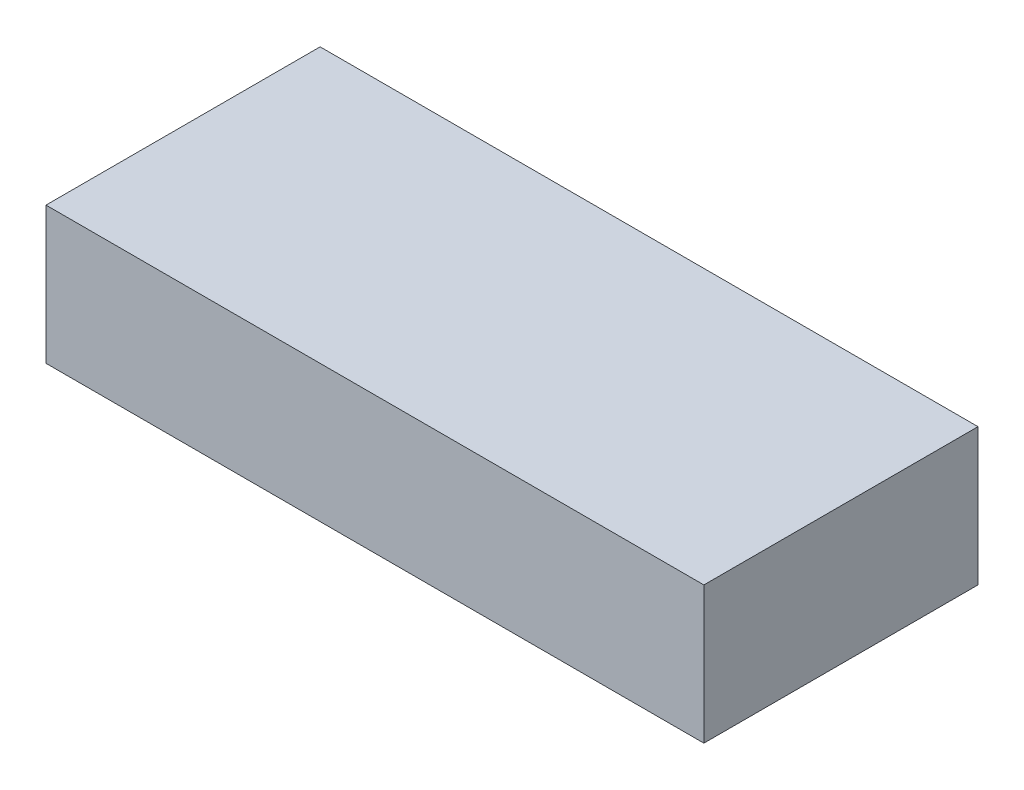
ISO-10303-21;
HEADER;
FILE_DESCRIPTION(('STEP AP214'),'2;1');
FILE_NAME('part.step','',(''),(''),'','','');
FILE_SCHEMA(('AUTOMOTIVE_DESIGN { 1 0 10303 214 1 1 1 1 }'));
ENDSEC;
DATA;
#1=APPLICATION_CONTEXT('core data for automotive mechanical design processes');
#2=APPLICATION_PROTOCOL_DEFINITION('international standard','automotive_design',2000,#1);
#3=PRODUCT_CONTEXT('',#1,'mechanical');
#4=PRODUCT('Part','Part','',(#3));
#5=PRODUCT_RELATED_PRODUCT_CATEGORY('part','',(#4));
#6=PRODUCT_DEFINITION_FORMATION('','',#4);
#7=PRODUCT_DEFINITION_CONTEXT('part definition',#1,'design');
#8=PRODUCT_DEFINITION('design','',#6,#7);
#9=PRODUCT_DEFINITION_SHAPE('','',#8);
#10=(LENGTH_UNIT() NAMED_UNIT(*) SI_UNIT(.MILLI.,.METRE.));
#11=(NAMED_UNIT(*) PLANE_ANGLE_UNIT() SI_UNIT($,.RADIAN.));
#12=(NAMED_UNIT(*) SI_UNIT($,.STERADIAN.) SOLID_ANGLE_UNIT());
#13=UNCERTAINTY_MEASURE_WITH_UNIT(LENGTH_MEASURE(1.E-05),#10,'distance_accuracy_value','');
#14=(GEOMETRIC_REPRESENTATION_CONTEXT(3) GLOBAL_UNCERTAINTY_ASSIGNED_CONTEXT((#13)) GLOBAL_UNIT_ASSIGNED_CONTEXT((#10,
#11,#12)) REPRESENTATION_CONTEXT('',''));
#15=CARTESIAN_POINT('',(0.,0.,0.));
#16=DIRECTION('',(0.,0.,1.));
#17=DIRECTION('',(1.,0.,0.));
#18=AXIS2_PLACEMENT_3D('',#15,#16,#17);
#19=CARTESIAN_POINT('',(0.0102075459339945,2.76860732929226,24.2545199157979));
#20=DIRECTION('',(0.,1.,0.));
#21=DIRECTION('',(1.,0.,0.));
#22=AXIS2_PLACEMENT_3D('',#19,#20,#21);
#23=PLANE('',#22);
#24=DIRECTION('',(1.,0.,0.));
#25=VECTOR('',#24,1.);
#26=CARTESIAN_POINT('',(-5.989792454066,2.76860732929226,21.7545199157979));
#27=LINE('',#26,#25);
#28=CARTESIAN_POINT('',(-5.989792454066,2.76860732929226,21.7545199157979));
#29=VERTEX_POINT('',#28);
#30=CARTESIAN_POINT('',(6.010207545934,2.76860732929226,21.7545199157979));
#31=VERTEX_POINT('',#30);
#32=EDGE_CURVE('E58',#29,#31,#27,.T.);
#33=ORIENTED_EDGE('',*,*,#32,.T.);
#34=DIRECTION('',(0.,0.,1.));
#35=VECTOR('',#34,1.);
#36=CARTESIAN_POINT('',(6.010207545934,2.76860732929226,21.7545199157979));
#37=LINE('',#36,#35);
#38=CARTESIAN_POINT('',(6.010207545934,2.76860732929226,26.7545199157979));
#39=VERTEX_POINT('',#38);
#40=EDGE_CURVE('E20',#31,#39,#37,.T.);
#41=ORIENTED_EDGE('',*,*,#40,.T.);
#42=DIRECTION('',(1.,0.,0.));
#43=VECTOR('',#42,1.);
#44=CARTESIAN_POINT('',(-5.989792454066,2.76860732929226,26.7545199157979));
#45=LINE('',#44,#43);
#46=CARTESIAN_POINT('',(-5.989792454066,2.76860732929226,26.7545199157979));
#47=VERTEX_POINT('',#46);
#48=EDGE_CURVE('E90',#39,#47,#45,.F.);
#49=ORIENTED_EDGE('',*,*,#48,.T.);
#50=DIRECTION('',(0.,0.,-1.));
#51=VECTOR('',#50,1.);
#52=CARTESIAN_POINT('',(-5.989792454066,2.76860732929226,21.7545199157979));
#53=LINE('',#52,#51);
#54=EDGE_CURVE('E56',#47,#29,#53,.T.);
#55=ORIENTED_EDGE('',*,*,#54,.T.);
#56=EDGE_LOOP('',(#33,#41,#49,#55));
#57=FACE_BOUND('',#56,.T.);
#58=ADVANCED_FACE('F17',(#57),#23,.F.);
#59=CARTESIAN_POINT('',(6.010207545934,5.26860732929226,21.7545199157979));
#60=DIRECTION('',(-1.,0.,0.));
#61=DIRECTION('',(0.,0.,1.));
#62=AXIS2_PLACEMENT_3D('',#59,#60,#61);
#63=PLANE('',#62);
#64=DIRECTION('',(0.,1.,0.));
#65=VECTOR('',#64,1.);
#66=CARTESIAN_POINT('',(6.010207545934,5.26860732929226,26.7545199157979));
#67=LINE('',#66,#65);
#68=CARTESIAN_POINT('',(6.010207545934,5.26860732929226,26.7545199157979));
#69=VERTEX_POINT('',#68);
#70=EDGE_CURVE('E70',#69,#39,#67,.F.);
#71=ORIENTED_EDGE('',*,*,#70,.T.);
#72=ORIENTED_EDGE('',*,*,#40,.F.);
#73=DIRECTION('',(0.,-1.,0.));
#74=VECTOR('',#73,1.);
#75=CARTESIAN_POINT('',(6.010207545934,5.26860732929226,21.7545199157979));
#76=LINE('',#75,#74);
#77=CARTESIAN_POINT('',(6.010207545934,5.26860732929226,21.7545199157979));
#78=VERTEX_POINT('',#77);
#79=EDGE_CURVE('E65',#31,#78,#76,.F.);
#80=ORIENTED_EDGE('',*,*,#79,.T.);
#81=DIRECTION('',(0.,0.,-1.));
#82=VECTOR('',#81,1.);
#83=CARTESIAN_POINT('',(6.010207545934,5.26860732929226,24.2545199157979));
#84=LINE('',#83,#82);
#85=EDGE_CURVE('E94',#69,#78,#84,.T.);
#86=ORIENTED_EDGE('',*,*,#85,.F.);
#87=EDGE_LOOP('',(#71,#72,#80,#86));
#88=FACE_BOUND('',#87,.T.);
#89=ADVANCED_FACE('F67',(#88),#63,.F.);
#90=CARTESIAN_POINT('',(-5.989792454066,5.26860732929226,21.7545199157979));
#91=DIRECTION('',(0.,0.,1.));
#92=DIRECTION('',(0.,-1.,0.));
#93=AXIS2_PLACEMENT_3D('',#90,#91,#92);
#94=PLANE('',#93);
#95=ORIENTED_EDGE('',*,*,#79,.F.);
#96=ORIENTED_EDGE('',*,*,#32,.F.);
#97=DIRECTION('',(0.,1.,0.));
#98=VECTOR('',#97,1.);
#99=CARTESIAN_POINT('',(-5.989792454066,5.26860732929226,21.7545199157979));
#100=LINE('',#99,#98);
#101=CARTESIAN_POINT('',(-5.989792454066,5.26860732929226,21.7545199157979));
#102=VERTEX_POINT('',#101);
#103=EDGE_CURVE('E83',#29,#102,#100,.T.);
#104=ORIENTED_EDGE('',*,*,#103,.T.);
#105=DIRECTION('',(1.,0.,0.));
#106=VECTOR('',#105,1.);
#107=CARTESIAN_POINT('',(0.0102075459339945,5.26860732929226,21.7545199157979));
#108=LINE('',#107,#106);
#109=EDGE_CURVE('E75',#78,#102,#108,.F.);
#110=ORIENTED_EDGE('',*,*,#109,.F.);
#111=EDGE_LOOP('',(#95,#96,#104,#110));
#112=FACE_BOUND('',#111,.T.);
#113=ADVANCED_FACE('F73',(#112),#94,.F.);
#114=CARTESIAN_POINT('',(-5.989792454066,5.26860732929226,21.7545199157979));
#115=DIRECTION('',(1.,0.,0.));
#116=DIRECTION('',(0.,0.,-1.));
#117=AXIS2_PLACEMENT_3D('',#114,#115,#116);
#118=PLANE('',#117);
#119=ORIENTED_EDGE('',*,*,#103,.F.);
#120=ORIENTED_EDGE('',*,*,#54,.F.);
#121=DIRECTION('',(0.,1.,0.));
#122=VECTOR('',#121,1.);
#123=CARTESIAN_POINT('',(-5.989792454066,5.26860732929226,26.7545199157979));
#124=LINE('',#123,#122);
#125=CARTESIAN_POINT('',(-5.989792454066,5.26860732929226,26.7545199157979));
#126=VERTEX_POINT('',#125);
#127=EDGE_CURVE('E36',#47,#126,#124,.T.);
#128=ORIENTED_EDGE('',*,*,#127,.T.);
#129=DIRECTION('',(0.,0.,-1.));
#130=VECTOR('',#129,1.);
#131=CARTESIAN_POINT('',(-5.989792454066,5.26860732929226,24.2545199157979));
#132=LINE('',#131,#130);
#133=EDGE_CURVE('E27',#102,#126,#132,.F.);
#134=ORIENTED_EDGE('',*,*,#133,.F.);
#135=EDGE_LOOP('',(#119,#120,#128,#134));
#136=FACE_BOUND('',#135,.T.);
#137=ADVANCED_FACE('F102',(#136),#118,.F.);
#138=CARTESIAN_POINT('',(-5.989792454066,5.26860732929226,26.7545199157979));
#139=DIRECTION('',(0.,0.,-1.));
#140=DIRECTION('',(0.,1.,0.));
#141=AXIS2_PLACEMENT_3D('',#138,#139,#140);
#142=PLANE('',#141);
#143=ORIENTED_EDGE('',*,*,#127,.F.);
#144=ORIENTED_EDGE('',*,*,#48,.F.);
#145=ORIENTED_EDGE('',*,*,#70,.F.);
#146=DIRECTION('',(1.,0.,0.));
#147=VECTOR('',#146,1.);
#148=CARTESIAN_POINT('',(0.0102075459339945,5.26860732929226,26.7545199157979));
#149=LINE('',#148,#147);
#150=EDGE_CURVE('E11',#126,#69,#149,.T.);
#151=ORIENTED_EDGE('',*,*,#150,.F.);
#152=EDGE_LOOP('',(#143,#144,#145,#151));
#153=FACE_BOUND('',#152,.T.);
#154=ADVANCED_FACE('F104',(#153),#142,.F.);
#155=CARTESIAN_POINT('',(0.0102075459339945,5.26860732929226,24.2545199157979));
#156=DIRECTION('',(0.,1.,0.));
#157=DIRECTION('',(1.,0.,0.));
#158=AXIS2_PLACEMENT_3D('',#155,#156,#157);
#159=PLANE('',#158);
#160=ORIENTED_EDGE('',*,*,#133,.T.);
#161=ORIENTED_EDGE('',*,*,#150,.T.);
#162=ORIENTED_EDGE('',*,*,#85,.T.);
#163=ORIENTED_EDGE('',*,*,#109,.T.);
#164=EDGE_LOOP('',(#160,#161,#162,#163));
#165=FACE_BOUND('',#164,.T.);
#166=ADVANCED_FACE('F101',(#165),#159,.T.);
#167=CLOSED_SHELL('',(#58,#89,#113,#137,#154,#166));
#168=MANIFOLD_SOLID_BREP('B1',#167);
#169=ADVANCED_BREP_SHAPE_REPRESENTATION('',(#18,#168),#14);
#170=SHAPE_DEFINITION_REPRESENTATION(#9,#169);
ENDSEC;
END-ISO-10303-21;
